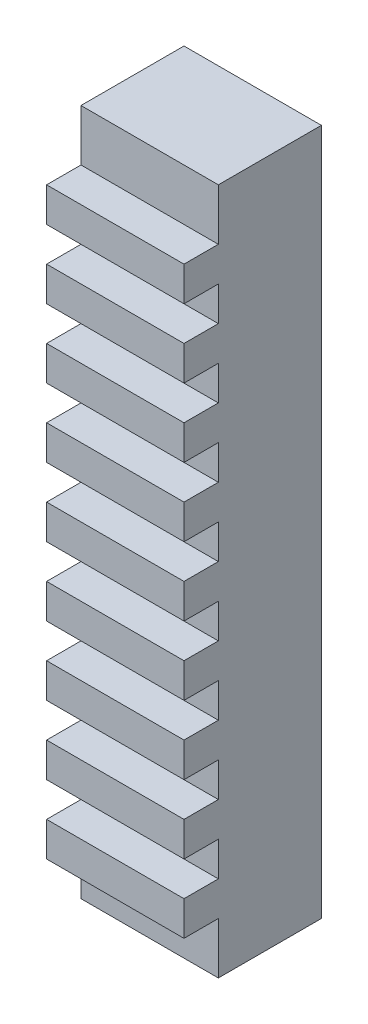
ISO-10303-21;
HEADER;
FILE_DESCRIPTION(('STEP AP214'),'2;1');
FILE_NAME('part.step','',(''),(''),'','','');
FILE_SCHEMA(('AUTOMOTIVE_DESIGN { 1 0 10303 214 1 1 1 1 }'));
ENDSEC;
DATA;
#1=APPLICATION_CONTEXT('core data for automotive mechanical design processes');
#2=APPLICATION_PROTOCOL_DEFINITION('international standard','automotive_design',2000,#1);
#3=PRODUCT_CONTEXT('',#1,'mechanical');
#4=PRODUCT('Part','Part','',(#3));
#5=PRODUCT_RELATED_PRODUCT_CATEGORY('part','',(#4));
#6=PRODUCT_DEFINITION_FORMATION('','',#4);
#7=PRODUCT_DEFINITION_CONTEXT('part definition',#1,'design');
#8=PRODUCT_DEFINITION('design','',#6,#7);
#9=PRODUCT_DEFINITION_SHAPE('','',#8);
#10=(LENGTH_UNIT() NAMED_UNIT(*) SI_UNIT(.MILLI.,.METRE.));
#11=(NAMED_UNIT(*) PLANE_ANGLE_UNIT() SI_UNIT($,.RADIAN.));
#12=(NAMED_UNIT(*) SI_UNIT($,.STERADIAN.) SOLID_ANGLE_UNIT());
#13=UNCERTAINTY_MEASURE_WITH_UNIT(LENGTH_MEASURE(1.E-05),#10,'distance_accuracy_value','');
#14=(GEOMETRIC_REPRESENTATION_CONTEXT(3) GLOBAL_UNCERTAINTY_ASSIGNED_CONTEXT((#13)) GLOBAL_UNIT_ASSIGNED_CONTEXT((#10,
#11,#12)) REPRESENTATION_CONTEXT('',''));
#15=CARTESIAN_POINT('',(0.,0.,0.));
#16=DIRECTION('',(0.,0.,1.));
#17=DIRECTION('',(1.,0.,0.));
#18=AXIS2_PLACEMENT_3D('',#15,#16,#17);
#19=CARTESIAN_POINT('',(0.,0.,15.));
#20=DIRECTION('',(0.,0.,-1.));
#21=DIRECTION('',(-1.,0.,0.));
#22=AXIS2_PLACEMENT_3D('',#19,#20,#21);
#23=PLANE('',#22);
#24=DIRECTION('',(-1.,0.,0.));
#25=VECTOR('',#24,1.);
#26=CARTESIAN_POINT('',(-10.,42.5,15.));
#27=LINE('',#26,#25);
#28=CARTESIAN_POINT('',(10.,42.5,15.));
#29=VERTEX_POINT('',#28);
#30=CARTESIAN_POINT('',(-10.,42.5,15.));
#31=VERTEX_POINT('',#30);
#32=EDGE_CURVE('E48',#29,#31,#27,.T.);
#33=ORIENTED_EDGE('',*,*,#32,.F.);
#34=DIRECTION('',(0.,1.,0.));
#35=VECTOR('',#34,1.);
#36=CARTESIAN_POINT('',(10.,-50.,15.));
#37=LINE('',#36,#35);
#38=CARTESIAN_POINT('',(10.,50.,15.));
#39=VERTEX_POINT('',#38);
#40=EDGE_CURVE('E540',#29,#39,#37,.T.);
#41=ORIENTED_EDGE('',*,*,#40,.T.);
#42=DIRECTION('',(-1.,0.,0.));
#43=VECTOR('',#42,1.);
#44=CARTESIAN_POINT('',(-10.,50.,15.));
#45=LINE('',#44,#43);
#46=CARTESIAN_POINT('',(-10.,50.,15.));
#47=VERTEX_POINT('',#46);
#48=EDGE_CURVE('E538',#39,#47,#45,.T.);
#49=ORIENTED_EDGE('',*,*,#48,.T.);
#50=DIRECTION('',(0.,-1.,0.));
#51=VECTOR('',#50,1.);
#52=CARTESIAN_POINT('',(-10.,-50.,15.));
#53=LINE('',#52,#51);
#54=EDGE_CURVE('E544',#47,#31,#53,.T.);
#55=ORIENTED_EDGE('',*,*,#54,.T.);
#56=EDGE_LOOP('',(#33,#41,#49,#55));
#57=FACE_BOUND('',#56,.T.);
#58=ADVANCED_FACE('F33',(#57),#23,.F.);
#59=DIRECTION('',(1.,0.,0.));
#60=VECTOR('',#59,1.);
#61=CARTESIAN_POINT('',(-10.,37.5,15.));
#62=LINE('',#61,#60);
#63=CARTESIAN_POINT('',(-10.,37.5,15.));
#64=VERTEX_POINT('',#63);
#65=CARTESIAN_POINT('',(10.,37.5,15.));
#66=VERTEX_POINT('',#65);
#67=EDGE_CURVE('E311',#64,#66,#62,.T.);
#68=ORIENTED_EDGE('',*,*,#67,.F.);
#69=CARTESIAN_POINT('',(-10.,32.5,15.));
#70=VERTEX_POINT('',#69);
#71=EDGE_CURVE('E547',#64,#70,#53,.T.);
#72=ORIENTED_EDGE('',*,*,#71,.T.);
#73=DIRECTION('',(-1.,0.,0.));
#74=VECTOR('',#73,1.);
#75=CARTESIAN_POINT('',(-10.,32.5,15.));
#76=LINE('',#75,#74);
#77=CARTESIAN_POINT('',(10.,32.5,15.));
#78=VERTEX_POINT('',#77);
#79=EDGE_CURVE('E314',#78,#70,#76,.T.);
#80=ORIENTED_EDGE('',*,*,#79,.F.);
#81=EDGE_CURVE('E56',#78,#66,#37,.T.);
#82=ORIENTED_EDGE('',*,*,#81,.T.);
#83=EDGE_LOOP('',(#68,#72,#80,#82));
#84=FACE_BOUND('',#83,.T.);
#85=ADVANCED_FACE('F639',(#84),#23,.F.);
#86=DIRECTION('',(1.,0.,0.));
#87=VECTOR('',#86,1.);
#88=CARTESIAN_POINT('',(-10.,27.5,15.));
#89=LINE('',#88,#87);
#90=CARTESIAN_POINT('',(-10.,27.5,15.));
#91=VERTEX_POINT('',#90);
#92=CARTESIAN_POINT('',(10.,27.5,15.));
#93=VERTEX_POINT('',#92);
#94=EDGE_CURVE('E317',#91,#93,#89,.T.);
#95=ORIENTED_EDGE('',*,*,#94,.F.);
#96=CARTESIAN_POINT('',(-10.,22.5,15.));
#97=VERTEX_POINT('',#96);
#98=EDGE_CURVE('E593',#91,#97,#53,.T.);
#99=ORIENTED_EDGE('',*,*,#98,.T.);
#100=DIRECTION('',(-1.,0.,0.));
#101=VECTOR('',#100,1.);
#102=CARTESIAN_POINT('',(-10.,22.5,15.));
#103=LINE('',#102,#101);
#104=CARTESIAN_POINT('',(10.,22.5,15.));
#105=VERTEX_POINT('',#104);
#106=EDGE_CURVE('E346',#105,#97,#103,.T.);
#107=ORIENTED_EDGE('',*,*,#106,.F.);
#108=EDGE_CURVE('E620',#105,#93,#37,.T.);
#109=ORIENTED_EDGE('',*,*,#108,.T.);
#110=EDGE_LOOP('',(#95,#99,#107,#109));
#111=FACE_BOUND('',#110,.T.);
#112=ADVANCED_FACE('F644',(#111),#23,.F.);
#113=DIRECTION('',(1.,0.,0.));
#114=VECTOR('',#113,1.);
#115=CARTESIAN_POINT('',(-10.,17.5,15.));
#116=LINE('',#115,#114);
#117=CARTESIAN_POINT('',(-10.,17.5,15.));
#118=VERTEX_POINT('',#117);
#119=CARTESIAN_POINT('',(10.,17.5,15.));
#120=VERTEX_POINT('',#119);
#121=EDGE_CURVE('E351',#118,#120,#116,.T.);
#122=ORIENTED_EDGE('',*,*,#121,.F.);
#123=CARTESIAN_POINT('',(-10.,12.5,15.));
#124=VERTEX_POINT('',#123);
#125=EDGE_CURVE('E591',#118,#124,#53,.T.);
#126=ORIENTED_EDGE('',*,*,#125,.T.);
#127=DIRECTION('',(-1.,0.,0.));
#128=VECTOR('',#127,1.);
#129=CARTESIAN_POINT('',(-10.,12.5,15.));
#130=LINE('',#129,#128);
#131=CARTESIAN_POINT('',(10.,12.5,15.));
#132=VERTEX_POINT('',#131);
#133=EDGE_CURVE('E454',#132,#124,#130,.T.);
#134=ORIENTED_EDGE('',*,*,#133,.F.);
#135=EDGE_CURVE('E622',#132,#120,#37,.T.);
#136=ORIENTED_EDGE('',*,*,#135,.T.);
#137=EDGE_LOOP('',(#122,#126,#134,#136));
#138=FACE_BOUND('',#137,.T.);
#139=ADVANCED_FACE('F735',(#138),#23,.F.);
#140=DIRECTION('',(-1.,0.,0.));
#141=VECTOR('',#140,1.);
#142=CARTESIAN_POINT('',(-10.,-37.5,15.));
#143=LINE('',#142,#141);
#144=CARTESIAN_POINT('',(10.,-37.5,15.));
#145=VERTEX_POINT('',#144);
#146=CARTESIAN_POINT('',(-10.,-37.5,15.));
#147=VERTEX_POINT('',#146);
#148=EDGE_CURVE('E373',#145,#147,#143,.T.);
#149=ORIENTED_EDGE('',*,*,#148,.F.);
#150=CARTESIAN_POINT('',(10.,-32.5,15.));
#151=VERTEX_POINT('',#150);
#152=EDGE_CURVE('E539',#145,#151,#37,.T.);
#153=ORIENTED_EDGE('',*,*,#152,.T.);
#154=DIRECTION('',(1.,0.,0.));
#155=VECTOR('',#154,1.);
#156=CARTESIAN_POINT('',(-10.,-32.5,15.));
#157=LINE('',#156,#155);
#158=CARTESIAN_POINT('',(-10.,-32.5,15.));
#159=VERTEX_POINT('',#158);
#160=EDGE_CURVE('E405',#159,#151,#157,.T.);
#161=ORIENTED_EDGE('',*,*,#160,.F.);
#162=EDGE_CURVE('E590',#159,#147,#53,.T.);
#163=ORIENTED_EDGE('',*,*,#162,.T.);
#164=EDGE_LOOP('',(#149,#153,#161,#163));
#165=FACE_BOUND('',#164,.T.);
#166=ADVANCED_FACE('F1005',(#165),#23,.F.);
#167=DIRECTION('',(1.,0.,0.));
#168=VECTOR('',#167,1.);
#169=CARTESIAN_POINT('',(-10.,-42.5,15.));
#170=LINE('',#169,#168);
#171=CARTESIAN_POINT('',(-10.,-42.5,15.));
#172=VERTEX_POINT('',#171);
#173=CARTESIAN_POINT('',(10.,-42.5,15.));
#174=VERTEX_POINT('',#173);
#175=EDGE_CURVE('E378',#172,#174,#170,.T.);
#176=ORIENTED_EDGE('',*,*,#175,.F.);
#177=CARTESIAN_POINT('',(-10.,-50.,15.));
#178=VERTEX_POINT('',#177);
#179=EDGE_CURVE('E543',#172,#178,#53,.T.);
#180=ORIENTED_EDGE('',*,*,#179,.T.);
#181=DIRECTION('',(1.,0.,0.));
#182=VECTOR('',#181,1.);
#183=CARTESIAN_POINT('',(-10.,-50.,15.));
#184=LINE('',#183,#182);
#185=CARTESIAN_POINT('',(10.,-50.,15.));
#186=VERTEX_POINT('',#185);
#187=EDGE_CURVE('E546',#178,#186,#184,.T.);
#188=ORIENTED_EDGE('',*,*,#187,.T.);
#189=EDGE_CURVE('E536',#186,#174,#37,.T.);
#190=ORIENTED_EDGE('',*,*,#189,.T.);
#191=EDGE_LOOP('',(#176,#180,#188,#190));
#192=FACE_BOUND('',#191,.T.);
#193=ADVANCED_FACE('F584',(#192),#23,.F.);
#194=DIRECTION('',(-1.,0.,0.));
#195=VECTOR('',#194,1.);
#196=CARTESIAN_POINT('',(-10.,-27.5,15.));
#197=LINE('',#196,#195);
#198=CARTESIAN_POINT('',(10.,-27.5,15.));
#199=VERTEX_POINT('',#198);
#200=CARTESIAN_POINT('',(-10.,-27.5,15.));
#201=VERTEX_POINT('',#200);
#202=EDGE_CURVE('E400',#199,#201,#197,.T.);
#203=ORIENTED_EDGE('',*,*,#202,.F.);
#204=CARTESIAN_POINT('',(10.,-22.5,15.));
#205=VERTEX_POINT('',#204);
#206=EDGE_CURVE('E616',#199,#205,#37,.T.);
#207=ORIENTED_EDGE('',*,*,#206,.T.);
#208=DIRECTION('',(1.,0.,0.));
#209=VECTOR('',#208,1.);
#210=CARTESIAN_POINT('',(-10.,-22.5,15.));
#211=LINE('',#210,#209);
#212=CARTESIAN_POINT('',(-10.,-22.5,15.));
#213=VERTEX_POINT('',#212);
#214=EDGE_CURVE('E432',#213,#205,#211,.T.);
#215=ORIENTED_EDGE('',*,*,#214,.F.);
#216=EDGE_CURVE('E592',#213,#201,#53,.T.);
#217=ORIENTED_EDGE('',*,*,#216,.T.);
#218=EDGE_LOOP('',(#203,#207,#215,#217));
#219=FACE_BOUND('',#218,.T.);
#220=ADVANCED_FACE('F602',(#219),#23,.F.);
#221=DIRECTION('',(-1.,0.,0.));
#222=VECTOR('',#221,1.);
#223=CARTESIAN_POINT('',(-10.,-17.5,15.));
#224=LINE('',#223,#222);
#225=CARTESIAN_POINT('',(10.,-17.5,15.));
#226=VERTEX_POINT('',#225);
#227=CARTESIAN_POINT('',(-10.,-17.5,15.));
#228=VERTEX_POINT('',#227);
#229=EDGE_CURVE('E427',#226,#228,#224,.T.);
#230=ORIENTED_EDGE('',*,*,#229,.F.);
#231=CARTESIAN_POINT('',(10.,-12.5,15.));
#232=VERTEX_POINT('',#231);
#233=EDGE_CURVE('E619',#226,#232,#37,.T.);
#234=ORIENTED_EDGE('',*,*,#233,.T.);
#235=DIRECTION('',(1.,0.,0.));
#236=VECTOR('',#235,1.);
#237=CARTESIAN_POINT('',(-10.,-12.5,15.));
#238=LINE('',#237,#236);
#239=CARTESIAN_POINT('',(-10.,-12.5,15.));
#240=VERTEX_POINT('',#239);
#241=EDGE_CURVE('E486',#240,#232,#238,.T.);
#242=ORIENTED_EDGE('',*,*,#241,.F.);
#243=EDGE_CURVE('E597',#240,#228,#53,.T.);
#244=ORIENTED_EDGE('',*,*,#243,.T.);
#245=EDGE_LOOP('',(#230,#234,#242,#244));
#246=FACE_BOUND('',#245,.T.);
#247=ADVANCED_FACE('F653',(#246),#23,.F.);
#248=DIRECTION('',(1.,0.,0.));
#249=VECTOR('',#248,1.);
#250=CARTESIAN_POINT('',(-10.,7.5,15.));
#251=LINE('',#250,#249);
#252=CARTESIAN_POINT('',(-10.,7.5,15.));
#253=VERTEX_POINT('',#252);
#254=CARTESIAN_POINT('',(10.,7.5,15.));
#255=VERTEX_POINT('',#254);
#256=EDGE_CURVE('E459',#253,#255,#251,.T.);
#257=ORIENTED_EDGE('',*,*,#256,.F.);
#258=CARTESIAN_POINT('',(-10.,2.5,15.));
#259=VERTEX_POINT('',#258);
#260=EDGE_CURVE('E594',#253,#259,#53,.T.);
#261=ORIENTED_EDGE('',*,*,#260,.T.);
#262=DIRECTION('',(-1.,0.,0.));
#263=VECTOR('',#262,1.);
#264=CARTESIAN_POINT('',(-10.,2.5,15.));
#265=LINE('',#264,#263);
#266=CARTESIAN_POINT('',(10.,2.5,15.));
#267=VERTEX_POINT('',#266);
#268=EDGE_CURVE('E508',#267,#259,#265,.T.);
#269=ORIENTED_EDGE('',*,*,#268,.F.);
#270=EDGE_CURVE('E541',#267,#255,#37,.T.);
#271=ORIENTED_EDGE('',*,*,#270,.T.);
#272=EDGE_LOOP('',(#257,#261,#269,#271));
#273=FACE_BOUND('',#272,.T.);
#274=ADVANCED_FACE('F648',(#273),#23,.F.);
#275=DIRECTION('',(-1.,0.,0.));
#276=VECTOR('',#275,1.);
#277=CARTESIAN_POINT('',(-10.,-7.5,15.));
#278=LINE('',#277,#276);
#279=CARTESIAN_POINT('',(10.,-7.5,15.));
#280=VERTEX_POINT('',#279);
#281=CARTESIAN_POINT('',(-10.,-7.5,15.));
#282=VERTEX_POINT('',#281);
#283=EDGE_CURVE('E481',#280,#282,#278,.T.);
#284=ORIENTED_EDGE('',*,*,#283,.F.);
#285=CARTESIAN_POINT('',(10.,-2.5,15.));
#286=VERTEX_POINT('',#285);
#287=EDGE_CURVE('E621',#280,#286,#37,.T.);
#288=ORIENTED_EDGE('',*,*,#287,.T.);
#289=DIRECTION('',(1.,0.,0.));
#290=VECTOR('',#289,1.);
#291=CARTESIAN_POINT('',(-10.,-2.5,15.));
#292=LINE('',#291,#290);
#293=CARTESIAN_POINT('',(-10.,-2.5,15.));
#294=VERTEX_POINT('',#293);
#295=EDGE_CURVE('E513',#294,#286,#292,.T.);
#296=ORIENTED_EDGE('',*,*,#295,.F.);
#297=EDGE_CURVE('E548',#294,#282,#53,.T.);
#298=ORIENTED_EDGE('',*,*,#297,.T.);
#299=EDGE_LOOP('',(#284,#288,#296,#298));
#300=FACE_BOUND('',#299,.T.);
#301=ADVANCED_FACE('F637',(#300),#23,.F.);
#302=CARTESIAN_POINT('',(10.,-50.,15.));
#303=DIRECTION('',(-1.,0.,0.));
#304=DIRECTION('',(0.,0.,1.));
#305=AXIS2_PLACEMENT_3D('',#302,#303,#304);
#306=PLANE('',#305);
#307=DIRECTION('',(0.,1.,0.));
#308=VECTOR('',#307,1.);
#309=CARTESIAN_POINT('',(10.,-50.,0.));
#310=LINE('',#309,#308);
#311=CARTESIAN_POINT('',(10.,-50.,0.));
#312=VERTEX_POINT('',#311);
#313=CARTESIAN_POINT('',(10.,50.,0.));
#314=VERTEX_POINT('',#313);
#315=EDGE_CURVE('E535',#312,#314,#310,.T.);
#316=ORIENTED_EDGE('',*,*,#315,.T.);
#317=DIRECTION('',(0.,0.,-1.));
#318=VECTOR('',#317,1.);
#319=CARTESIAN_POINT('',(10.,50.,15.));
#320=LINE('',#319,#318);
#321=EDGE_CURVE('E11',#39,#314,#320,.T.);
#322=ORIENTED_EDGE('',*,*,#321,.F.);
#323=ORIENTED_EDGE('',*,*,#40,.F.);
#324=DIRECTION('',(0.,0.,-1.));
#325=VECTOR('',#324,1.);
#326=CARTESIAN_POINT('',(10.,42.5,20.));
#327=LINE('',#326,#325);
#328=CARTESIAN_POINT('',(10.,42.5,20.));
#329=VERTEX_POINT('',#328);
#330=EDGE_CURVE('E765',#329,#29,#327,.T.);
#331=ORIENTED_EDGE('',*,*,#330,.F.);
#332=DIRECTION('',(0.,1.,0.));
#333=VECTOR('',#332,1.);
#334=CARTESIAN_POINT('',(10.,37.5,20.));
#335=LINE('',#334,#333);
#336=CARTESIAN_POINT('',(10.,37.5,20.));
#337=VERTEX_POINT('',#336);
#338=EDGE_CURVE('E307',#337,#329,#335,.T.);
#339=ORIENTED_EDGE('',*,*,#338,.F.);
#340=DIRECTION('',(0.,0.,-1.));
#341=VECTOR('',#340,1.);
#342=CARTESIAN_POINT('',(10.,37.5,20.));
#343=LINE('',#342,#341);
#344=EDGE_CURVE('E319',#337,#66,#343,.T.);
#345=ORIENTED_EDGE('',*,*,#344,.T.);
#346=ORIENTED_EDGE('',*,*,#81,.F.);
#347=DIRECTION('',(0.,0.,-1.));
#348=VECTOR('',#347,1.);
#349=CARTESIAN_POINT('',(10.,32.5,20.));
#350=LINE('',#349,#348);
#351=CARTESIAN_POINT('',(10.,32.5,20.));
#352=VERTEX_POINT('',#351);
#353=EDGE_CURVE('E331',#352,#78,#350,.T.);
#354=ORIENTED_EDGE('',*,*,#353,.F.);
#355=DIRECTION('',(0.,1.,0.));
#356=VECTOR('',#355,1.);
#357=CARTESIAN_POINT('',(10.,27.5,20.));
#358=LINE('',#357,#356);
#359=CARTESIAN_POINT('',(10.,27.5,20.));
#360=VERTEX_POINT('',#359);
#361=EDGE_CURVE('E330',#360,#352,#358,.T.);
#362=ORIENTED_EDGE('',*,*,#361,.F.);
#363=DIRECTION('',(0.,0.,-1.));
#364=VECTOR('',#363,1.);
#365=CARTESIAN_POINT('',(10.,27.5,20.));
#366=LINE('',#365,#364);
#367=EDGE_CURVE('E337',#360,#93,#366,.T.);
#368=ORIENTED_EDGE('',*,*,#367,.T.);
#369=ORIENTED_EDGE('',*,*,#108,.F.);
#370=DIRECTION('',(0.,0.,-1.));
#371=VECTOR('',#370,1.);
#372=CARTESIAN_POINT('',(10.,22.5,20.));
#373=LINE('',#372,#371);
#374=CARTESIAN_POINT('',(10.,22.5,20.));
#375=VERTEX_POINT('',#374);
#376=EDGE_CURVE('E357',#375,#105,#373,.T.);
#377=ORIENTED_EDGE('',*,*,#376,.F.);
#378=DIRECTION('',(0.,1.,0.));
#379=VECTOR('',#378,1.);
#380=CARTESIAN_POINT('',(10.,17.5,20.));
#381=LINE('',#380,#379);
#382=CARTESIAN_POINT('',(10.,17.5,20.));
#383=VERTEX_POINT('',#382);
#384=EDGE_CURVE('E355',#383,#375,#381,.T.);
#385=ORIENTED_EDGE('',*,*,#384,.F.);
#386=DIRECTION('',(0.,0.,-1.));
#387=VECTOR('',#386,1.);
#388=CARTESIAN_POINT('',(10.,17.5,20.));
#389=LINE('',#388,#387);
#390=EDGE_CURVE('E364',#383,#120,#389,.T.);
#391=ORIENTED_EDGE('',*,*,#390,.T.);
#392=ORIENTED_EDGE('',*,*,#135,.F.);
#393=DIRECTION('',(0.,0.,-1.));
#394=VECTOR('',#393,1.);
#395=CARTESIAN_POINT('',(10.,12.5,20.));
#396=LINE('',#395,#394);
#397=CARTESIAN_POINT('',(10.,12.5,20.));
#398=VERTEX_POINT('',#397);
#399=EDGE_CURVE('E465',#398,#132,#396,.T.);
#400=ORIENTED_EDGE('',*,*,#399,.F.);
#401=DIRECTION('',(0.,1.,0.));
#402=VECTOR('',#401,1.);
#403=CARTESIAN_POINT('',(10.,7.5,20.));
#404=LINE('',#403,#402);
#405=CARTESIAN_POINT('',(10.,7.5,20.));
#406=VERTEX_POINT('',#405);
#407=EDGE_CURVE('E463',#406,#398,#404,.T.);
#408=ORIENTED_EDGE('',*,*,#407,.F.);
#409=DIRECTION('',(0.,0.,-1.));
#410=VECTOR('',#409,1.);
#411=CARTESIAN_POINT('',(10.,7.5,20.));
#412=LINE('',#411,#410);
#413=EDGE_CURVE('E472',#406,#255,#412,.T.);
#414=ORIENTED_EDGE('',*,*,#413,.T.);
#415=ORIENTED_EDGE('',*,*,#270,.F.);
#416=DIRECTION('',(0.,0.,-1.));
#417=VECTOR('',#416,1.);
#418=CARTESIAN_POINT('',(10.,2.5,20.));
#419=LINE('',#418,#417);
#420=CARTESIAN_POINT('',(10.,2.5,20.));
#421=VERTEX_POINT('',#420);
#422=EDGE_CURVE('E532',#421,#267,#419,.T.);
#423=ORIENTED_EDGE('',*,*,#422,.F.);
#424=DIRECTION('',(0.,1.,0.));
#425=VECTOR('',#424,1.);
#426=CARTESIAN_POINT('',(10.,-2.5,20.));
#427=LINE('',#426,#425);
#428=CARTESIAN_POINT('',(10.,-2.5,20.));
#429=VERTEX_POINT('',#428);
#430=EDGE_CURVE('E509',#429,#421,#427,.T.);
#431=ORIENTED_EDGE('',*,*,#430,.F.);
#432=DIRECTION('',(0.,0.,-1.));
#433=VECTOR('',#432,1.);
#434=CARTESIAN_POINT('',(10.,-2.5,20.));
#435=LINE('',#434,#433);
#436=EDGE_CURVE('E519',#429,#286,#435,.T.);
#437=ORIENTED_EDGE('',*,*,#436,.T.);
#438=ORIENTED_EDGE('',*,*,#287,.F.);
#439=DIRECTION('',(0.,0.,-1.));
#440=VECTOR('',#439,1.);
#441=CARTESIAN_POINT('',(10.,-7.5,20.));
#442=LINE('',#441,#440);
#443=CARTESIAN_POINT('',(10.,-7.5,20.));
#444=VERTEX_POINT('',#443);
#445=EDGE_CURVE('E505',#444,#280,#442,.T.);
#446=ORIENTED_EDGE('',*,*,#445,.F.);
#447=DIRECTION('',(0.,1.,0.));
#448=VECTOR('',#447,1.);
#449=CARTESIAN_POINT('',(10.,-12.5,20.));
#450=LINE('',#449,#448);
#451=CARTESIAN_POINT('',(10.,-12.5,20.));
#452=VERTEX_POINT('',#451);
#453=EDGE_CURVE('E482',#452,#444,#450,.T.);
#454=ORIENTED_EDGE('',*,*,#453,.F.);
#455=DIRECTION('',(0.,0.,-1.));
#456=VECTOR('',#455,1.);
#457=CARTESIAN_POINT('',(10.,-12.5,20.));
#458=LINE('',#457,#456);
#459=EDGE_CURVE('E492',#452,#232,#458,.T.);
#460=ORIENTED_EDGE('',*,*,#459,.T.);
#461=ORIENTED_EDGE('',*,*,#233,.F.);
#462=DIRECTION('',(0.,0.,-1.));
#463=VECTOR('',#462,1.);
#464=CARTESIAN_POINT('',(10.,-17.5,20.));
#465=LINE('',#464,#463);
#466=CARTESIAN_POINT('',(10.,-17.5,20.));
#467=VERTEX_POINT('',#466);
#468=EDGE_CURVE('E451',#467,#226,#465,.T.);
#469=ORIENTED_EDGE('',*,*,#468,.F.);
#470=DIRECTION('',(0.,1.,0.));
#471=VECTOR('',#470,1.);
#472=CARTESIAN_POINT('',(10.,-22.5,20.));
#473=LINE('',#472,#471);
#474=CARTESIAN_POINT('',(10.,-22.5,20.));
#475=VERTEX_POINT('',#474);
#476=EDGE_CURVE('E428',#475,#467,#473,.T.);
#477=ORIENTED_EDGE('',*,*,#476,.F.);
#478=DIRECTION('',(0.,0.,-1.));
#479=VECTOR('',#478,1.);
#480=CARTESIAN_POINT('',(10.,-22.5,20.));
#481=LINE('',#480,#479);
#482=EDGE_CURVE('E438',#475,#205,#481,.T.);
#483=ORIENTED_EDGE('',*,*,#482,.T.);
#484=ORIENTED_EDGE('',*,*,#206,.F.);
#485=DIRECTION('',(0.,0.,-1.));
#486=VECTOR('',#485,1.);
#487=CARTESIAN_POINT('',(10.,-27.5,20.));
#488=LINE('',#487,#486);
#489=CARTESIAN_POINT('',(10.,-27.5,20.));
#490=VERTEX_POINT('',#489);
#491=EDGE_CURVE('E424',#490,#199,#488,.T.);
#492=ORIENTED_EDGE('',*,*,#491,.F.);
#493=DIRECTION('',(0.,1.,0.));
#494=VECTOR('',#493,1.);
#495=CARTESIAN_POINT('',(10.,-32.5,20.));
#496=LINE('',#495,#494);
#497=CARTESIAN_POINT('',(10.,-32.5,20.));
#498=VERTEX_POINT('',#497);
#499=EDGE_CURVE('E401',#498,#490,#496,.T.);
#500=ORIENTED_EDGE('',*,*,#499,.F.);
#501=DIRECTION('',(0.,0.,-1.));
#502=VECTOR('',#501,1.);
#503=CARTESIAN_POINT('',(10.,-32.5,20.));
#504=LINE('',#503,#502);
#505=EDGE_CURVE('E411',#498,#151,#504,.T.);
#506=ORIENTED_EDGE('',*,*,#505,.T.);
#507=ORIENTED_EDGE('',*,*,#152,.F.);
#508=DIRECTION('',(0.,0.,-1.));
#509=VECTOR('',#508,1.);
#510=CARTESIAN_POINT('',(10.,-37.5,20.));
#511=LINE('',#510,#509);
#512=CARTESIAN_POINT('',(10.,-37.5,20.));
#513=VERTEX_POINT('',#512);
#514=EDGE_CURVE('E397',#513,#145,#511,.T.);
#515=ORIENTED_EDGE('',*,*,#514,.F.);
#516=DIRECTION('',(0.,1.,0.));
#517=VECTOR('',#516,1.);
#518=CARTESIAN_POINT('',(10.,-42.5,20.));
#519=LINE('',#518,#517);
#520=CARTESIAN_POINT('',(10.,-42.5,20.));
#521=VERTEX_POINT('',#520);
#522=EDGE_CURVE('E374',#521,#513,#519,.T.);
#523=ORIENTED_EDGE('',*,*,#522,.F.);
#524=DIRECTION('',(0.,0.,-1.));
#525=VECTOR('',#524,1.);
#526=CARTESIAN_POINT('',(10.,-42.5,20.));
#527=LINE('',#526,#525);
#528=EDGE_CURVE('E384',#521,#174,#527,.T.);
#529=ORIENTED_EDGE('',*,*,#528,.T.);
#530=ORIENTED_EDGE('',*,*,#189,.F.);
#531=DIRECTION('',(0.,0.,-1.));
#532=VECTOR('',#531,1.);
#533=CARTESIAN_POINT('',(10.,-50.,15.));
#534=LINE('',#533,#532);
#535=EDGE_CURVE('E550',#186,#312,#534,.T.);
#536=ORIENTED_EDGE('',*,*,#535,.T.);
#537=EDGE_LOOP('',(#316,#322,#323,#331,#339,#345,#346,#354,#362,#368,#369,#377,#385,#391,#392,
#400,#408,#414,#415,#423,#431,#437,#438,#446,#454,#460,#461,#469,#477,#483,#484,#492,#500,#506,
#507,#515,#523,#529,#530,#536));
#538=FACE_BOUND('',#537,.T.);
#539=ADVANCED_FACE('F35',(#538),#306,.F.);
#540=CARTESIAN_POINT('',(-10.,50.,15.));
#541=DIRECTION('',(0.,-1.,0.));
#542=DIRECTION('',(0.,0.,-1.));
#543=AXIS2_PLACEMENT_3D('',#540,#541,#542);
#544=PLANE('',#543);
#545=DIRECTION('',(-1.,0.,0.));
#546=VECTOR('',#545,1.);
#547=CARTESIAN_POINT('',(-10.,50.,0.));
#548=LINE('',#547,#546);
#549=CARTESIAN_POINT('',(-10.,50.,0.));
#550=VERTEX_POINT('',#549);
#551=EDGE_CURVE('E553',#314,#550,#548,.T.);
#552=ORIENTED_EDGE('',*,*,#551,.T.);
#553=DIRECTION('',(0.,0.,-1.));
#554=VECTOR('',#553,1.);
#555=CARTESIAN_POINT('',(-10.,50.,15.));
#556=LINE('',#555,#554);
#557=EDGE_CURVE('E41',#47,#550,#556,.T.);
#558=ORIENTED_EDGE('',*,*,#557,.F.);
#559=ORIENTED_EDGE('',*,*,#48,.F.);
#560=ORIENTED_EDGE('',*,*,#321,.T.);
#561=EDGE_LOOP('',(#552,#558,#559,#560));
#562=FACE_BOUND('',#561,.T.);
#563=ADVANCED_FACE('F630',(#562),#544,.F.);
#564=CARTESIAN_POINT('',(-10.,-50.,15.));
#565=DIRECTION('',(1.,0.,0.));
#566=DIRECTION('',(0.,0.,-1.));
#567=AXIS2_PLACEMENT_3D('',#564,#565,#566);
#568=PLANE('',#567);
#569=DIRECTION('',(0.,-1.,0.));
#570=VECTOR('',#569,1.);
#571=CARTESIAN_POINT('',(-10.,-50.,0.));
#572=LINE('',#571,#570);
#573=CARTESIAN_POINT('',(-10.,-50.,0.));
#574=VERTEX_POINT('',#573);
#575=EDGE_CURVE('E555',#550,#574,#572,.T.);
#576=ORIENTED_EDGE('',*,*,#575,.T.);
#577=DIRECTION('',(0.,0.,-1.));
#578=VECTOR('',#577,1.);
#579=CARTESIAN_POINT('',(-10.,-50.,15.));
#580=LINE('',#579,#578);
#581=EDGE_CURVE('E561',#178,#574,#580,.T.);
#582=ORIENTED_EDGE('',*,*,#581,.F.);
#583=ORIENTED_EDGE('',*,*,#179,.F.);
#584=DIRECTION('',(0.,0.,-1.));
#585=VECTOR('',#584,1.);
#586=CARTESIAN_POINT('',(-10.,-42.5,20.));
#587=LINE('',#586,#585);
#588=CARTESIAN_POINT('',(-10.,-42.5,20.));
#589=VERTEX_POINT('',#588);
#590=EDGE_CURVE('E391',#589,#172,#587,.T.);
#591=ORIENTED_EDGE('',*,*,#590,.F.);
#592=DIRECTION('',(0.,-1.,0.));
#593=VECTOR('',#592,1.);
#594=CARTESIAN_POINT('',(-10.,-42.5,20.));
#595=LINE('',#594,#593);
#596=CARTESIAN_POINT('',(-10.,-37.5,20.));
#597=VERTEX_POINT('',#596);
#598=EDGE_CURVE('E380',#597,#589,#595,.T.);
#599=ORIENTED_EDGE('',*,*,#598,.F.);
#600=DIRECTION('',(0.,0.,-1.));
#601=VECTOR('',#600,1.);
#602=CARTESIAN_POINT('',(-10.,-37.5,20.));
#603=LINE('',#602,#601);
#604=EDGE_CURVE('E394',#597,#147,#603,.T.);
#605=ORIENTED_EDGE('',*,*,#604,.T.);
#606=ORIENTED_EDGE('',*,*,#162,.F.);
#607=DIRECTION('',(0.,0.,-1.));
#608=VECTOR('',#607,1.);
#609=CARTESIAN_POINT('',(-10.,-32.5,20.));
#610=LINE('',#609,#608);
#611=CARTESIAN_POINT('',(-10.,-32.5,20.));
#612=VERTEX_POINT('',#611);
#613=EDGE_CURVE('E418',#612,#159,#610,.T.);
#614=ORIENTED_EDGE('',*,*,#613,.F.);
#615=DIRECTION('',(0.,-1.,0.));
#616=VECTOR('',#615,1.);
#617=CARTESIAN_POINT('',(-10.,-32.5,20.));
#618=LINE('',#617,#616);
#619=CARTESIAN_POINT('',(-10.,-27.5,20.));
#620=VERTEX_POINT('',#619);
#621=EDGE_CURVE('E407',#620,#612,#618,.T.);
#622=ORIENTED_EDGE('',*,*,#621,.F.);
#623=DIRECTION('',(0.,0.,-1.));
#624=VECTOR('',#623,1.);
#625=CARTESIAN_POINT('',(-10.,-27.5,20.));
#626=LINE('',#625,#624);
#627=EDGE_CURVE('E421',#620,#201,#626,.T.);
#628=ORIENTED_EDGE('',*,*,#627,.T.);
#629=ORIENTED_EDGE('',*,*,#216,.F.);
#630=DIRECTION('',(0.,0.,-1.));
#631=VECTOR('',#630,1.);
#632=CARTESIAN_POINT('',(-10.,-22.5,20.));
#633=LINE('',#632,#631);
#634=CARTESIAN_POINT('',(-10.,-22.5,20.));
#635=VERTEX_POINT('',#634);
#636=EDGE_CURVE('E445',#635,#213,#633,.T.);
#637=ORIENTED_EDGE('',*,*,#636,.F.);
#638=DIRECTION('',(0.,-1.,0.));
#639=VECTOR('',#638,1.);
#640=CARTESIAN_POINT('',(-10.,-22.5,20.));
#641=LINE('',#640,#639);
#642=CARTESIAN_POINT('',(-10.,-17.5,20.));
#643=VERTEX_POINT('',#642);
#644=EDGE_CURVE('E434',#643,#635,#641,.T.);
#645=ORIENTED_EDGE('',*,*,#644,.F.);
#646=DIRECTION('',(0.,0.,-1.));
#647=VECTOR('',#646,1.);
#648=CARTESIAN_POINT('',(-10.,-17.5,20.));
#649=LINE('',#648,#647);
#650=EDGE_CURVE('E448',#643,#228,#649,.T.);
#651=ORIENTED_EDGE('',*,*,#650,.T.);
#652=ORIENTED_EDGE('',*,*,#243,.F.);
#653=DIRECTION('',(0.,0.,-1.));
#654=VECTOR('',#653,1.);
#655=CARTESIAN_POINT('',(-10.,-12.5,20.));
#656=LINE('',#655,#654);
#657=CARTESIAN_POINT('',(-10.,-12.5,20.));
#658=VERTEX_POINT('',#657);
#659=EDGE_CURVE('E499',#658,#240,#656,.T.);
#660=ORIENTED_EDGE('',*,*,#659,.F.);
#661=DIRECTION('',(0.,-1.,0.));
#662=VECTOR('',#661,1.);
#663=CARTESIAN_POINT('',(-10.,-12.5,20.));
#664=LINE('',#663,#662);
#665=CARTESIAN_POINT('',(-10.,-7.5,20.));
#666=VERTEX_POINT('',#665);
#667=EDGE_CURVE('E488',#666,#658,#664,.T.);
#668=ORIENTED_EDGE('',*,*,#667,.F.);
#669=DIRECTION('',(0.,0.,-1.));
#670=VECTOR('',#669,1.);
#671=CARTESIAN_POINT('',(-10.,-7.5,20.));
#672=LINE('',#671,#670);
#673=EDGE_CURVE('E502',#666,#282,#672,.T.);
#674=ORIENTED_EDGE('',*,*,#673,.T.);
#675=ORIENTED_EDGE('',*,*,#297,.F.);
#676=DIRECTION('',(0.,0.,-1.));
#677=VECTOR('',#676,1.);
#678=CARTESIAN_POINT('',(-10.,-2.5,20.));
#679=LINE('',#678,#677);
#680=CARTESIAN_POINT('',(-10.,-2.5,20.));
#681=VERTEX_POINT('',#680);
#682=EDGE_CURVE('E526',#681,#294,#679,.T.);
#683=ORIENTED_EDGE('',*,*,#682,.F.);
#684=DIRECTION('',(0.,-1.,0.));
#685=VECTOR('',#684,1.);
#686=CARTESIAN_POINT('',(-10.,-2.5,20.));
#687=LINE('',#686,#685);
#688=CARTESIAN_POINT('',(-10.,2.5,20.));
#689=VERTEX_POINT('',#688);
#690=EDGE_CURVE('E515',#689,#681,#687,.T.);
#691=ORIENTED_EDGE('',*,*,#690,.F.);
#692=DIRECTION('',(0.,0.,-1.));
#693=VECTOR('',#692,1.);
#694=CARTESIAN_POINT('',(-10.,2.5,20.));
#695=LINE('',#694,#693);
#696=EDGE_CURVE('E529',#689,#259,#695,.T.);
#697=ORIENTED_EDGE('',*,*,#696,.T.);
#698=ORIENTED_EDGE('',*,*,#260,.F.);
#699=DIRECTION('',(0.,0.,-1.));
#700=VECTOR('',#699,1.);
#701=CARTESIAN_POINT('',(-10.,7.5,20.));
#702=LINE('',#701,#700);
#703=CARTESIAN_POINT('',(-10.,7.5,20.));
#704=VERTEX_POINT('',#703);
#705=EDGE_CURVE('E475',#704,#253,#702,.T.);
#706=ORIENTED_EDGE('',*,*,#705,.F.);
#707=DIRECTION('',(0.,-1.,0.));
#708=VECTOR('',#707,1.);
#709=CARTESIAN_POINT('',(-10.,7.5,20.));
#710=LINE('',#709,#708);
#711=CARTESIAN_POINT('',(-10.,12.5,20.));
#712=VERTEX_POINT('',#711);
#713=EDGE_CURVE('E458',#712,#704,#710,.T.);
#714=ORIENTED_EDGE('',*,*,#713,.F.);
#715=DIRECTION('',(0.,0.,-1.));
#716=VECTOR('',#715,1.);
#717=CARTESIAN_POINT('',(-10.,12.5,20.));
#718=LINE('',#717,#716);
#719=EDGE_CURVE('E478',#712,#124,#718,.T.);
#720=ORIENTED_EDGE('',*,*,#719,.T.);
#721=ORIENTED_EDGE('',*,*,#125,.F.);
#722=DIRECTION('',(0.,0.,-1.));
#723=VECTOR('',#722,1.);
#724=CARTESIAN_POINT('',(-10.,17.5,20.));
#725=LINE('',#724,#723);
#726=CARTESIAN_POINT('',(-10.,17.5,20.));
#727=VERTEX_POINT('',#726);
#728=EDGE_CURVE('E367',#727,#118,#725,.T.);
#729=ORIENTED_EDGE('',*,*,#728,.F.);
#730=DIRECTION('',(0.,-1.,0.));
#731=VECTOR('',#730,1.);
#732=CARTESIAN_POINT('',(-10.,17.5,20.));
#733=LINE('',#732,#731);
#734=CARTESIAN_POINT('',(-10.,22.5,20.));
#735=VERTEX_POINT('',#734);
#736=EDGE_CURVE('E350',#735,#727,#733,.T.);
#737=ORIENTED_EDGE('',*,*,#736,.F.);
#738=DIRECTION('',(0.,0.,-1.));
#739=VECTOR('',#738,1.);
#740=CARTESIAN_POINT('',(-10.,22.5,20.));
#741=LINE('',#740,#739);
#742=EDGE_CURVE('E370',#735,#97,#741,.T.);
#743=ORIENTED_EDGE('',*,*,#742,.T.);
#744=ORIENTED_EDGE('',*,*,#98,.F.);
#745=DIRECTION('',(0.,0.,-1.));
#746=VECTOR('',#745,1.);
#747=CARTESIAN_POINT('',(-10.,27.5,20.));
#748=LINE('',#747,#746);
#749=CARTESIAN_POINT('',(-10.,27.5,20.));
#750=VERTEX_POINT('',#749);
#751=EDGE_CURVE('E340',#750,#91,#748,.T.);
#752=ORIENTED_EDGE('',*,*,#751,.F.);
#753=DIRECTION('',(0.,-1.,0.));
#754=VECTOR('',#753,1.);
#755=CARTESIAN_POINT('',(-10.,27.5,20.));
#756=LINE('',#755,#754);
#757=CARTESIAN_POINT('',(-10.,32.5,20.));
#758=VERTEX_POINT('',#757);
#759=EDGE_CURVE('E326',#758,#750,#756,.T.);
#760=ORIENTED_EDGE('',*,*,#759,.F.);
#761=DIRECTION('',(0.,0.,-1.));
#762=VECTOR('',#761,1.);
#763=CARTESIAN_POINT('',(-10.,32.5,20.));
#764=LINE('',#763,#762);
#765=EDGE_CURVE('E343',#758,#70,#764,.T.);
#766=ORIENTED_EDGE('',*,*,#765,.T.);
#767=ORIENTED_EDGE('',*,*,#71,.F.);
#768=DIRECTION('',(0.,0.,-1.));
#769=VECTOR('',#768,1.);
#770=CARTESIAN_POINT('',(-10.,37.5,20.));
#771=LINE('',#770,#769);
#772=CARTESIAN_POINT('',(-10.,37.5,20.));
#773=VERTEX_POINT('',#772);
#774=EDGE_CURVE('E298',#773,#64,#771,.T.);
#775=ORIENTED_EDGE('',*,*,#774,.F.);
#776=DIRECTION('',(0.,-1.,0.));
#777=VECTOR('',#776,1.);
#778=CARTESIAN_POINT('',(-10.,37.5,20.));
#779=LINE('',#778,#777);
#780=CARTESIAN_POINT('',(-10.,42.5,20.));
#781=VERTEX_POINT('',#780);
#782=EDGE_CURVE('E291',#781,#773,#779,.T.);
#783=ORIENTED_EDGE('',*,*,#782,.F.);
#784=DIRECTION('',(0.,0.,-1.));
#785=VECTOR('',#784,1.);
#786=CARTESIAN_POINT('',(-10.,42.5,20.));
#787=LINE('',#786,#785);
#788=EDGE_CURVE('E296',#781,#31,#787,.T.);
#789=ORIENTED_EDGE('',*,*,#788,.T.);
#790=ORIENTED_EDGE('',*,*,#54,.F.);
#791=ORIENTED_EDGE('',*,*,#557,.T.);
#792=EDGE_LOOP('',(#576,#582,#583,#591,#599,#605,#606,#614,#622,#628,#629,#637,#645,#651,#652,
#660,#668,#674,#675,#683,#691,#697,#698,#706,#714,#720,#721,#729,#737,#743,#744,#752,#760,#766,
#767,#775,#783,#789,#790,#791));
#793=FACE_BOUND('',#792,.T.);
#794=ADVANCED_FACE('F293',(#793),#568,.F.);
#795=CARTESIAN_POINT('',(-10.,-50.,15.));
#796=DIRECTION('',(0.,1.,0.));
#797=DIRECTION('',(0.,0.,1.));
#798=AXIS2_PLACEMENT_3D('',#795,#796,#797);
#799=PLANE('',#798);
#800=DIRECTION('',(1.,0.,0.));
#801=VECTOR('',#800,1.);
#802=CARTESIAN_POINT('',(-10.,-50.,0.));
#803=LINE('',#802,#801);
#804=EDGE_CURVE('E557',#574,#312,#803,.T.);
#805=ORIENTED_EDGE('',*,*,#804,.T.);
#806=ORIENTED_EDGE('',*,*,#535,.F.);
#807=ORIENTED_EDGE('',*,*,#187,.F.);
#808=ORIENTED_EDGE('',*,*,#581,.T.);
#809=EDGE_LOOP('',(#805,#806,#807,#808));
#810=FACE_BOUND('',#809,.T.);
#811=ADVANCED_FACE('F575',(#810),#799,.F.);
#812=CARTESIAN_POINT('',(0.,0.,0.));
#813=DIRECTION('',(0.,0.,-1.));
#814=DIRECTION('',(-1.,0.,0.));
#815=AXIS2_PLACEMENT_3D('',#812,#813,#814);
#816=PLANE('',#815);
#817=ORIENTED_EDGE('',*,*,#315,.F.);
#818=ORIENTED_EDGE('',*,*,#804,.F.);
#819=ORIENTED_EDGE('',*,*,#575,.F.);
#820=ORIENTED_EDGE('',*,*,#551,.F.);
#821=EDGE_LOOP('',(#817,#818,#819,#820));
#822=FACE_BOUND('',#821,.T.);
#823=ADVANCED_FACE('F572',(#822),#816,.T.);
#824=CARTESIAN_POINT('',(-10.,2.5,20.));
#825=DIRECTION('',(0.,-1.,0.));
#826=DIRECTION('',(0.,0.,-1.));
#827=AXIS2_PLACEMENT_3D('',#824,#825,#826);
#828=PLANE('',#827);
#829=ORIENTED_EDGE('',*,*,#268,.T.);
#830=ORIENTED_EDGE('',*,*,#696,.F.);
#831=DIRECTION('',(-1.,0.,0.));
#832=VECTOR('',#831,1.);
#833=CARTESIAN_POINT('',(-10.,2.5,20.));
#834=LINE('',#833,#832);
#835=EDGE_CURVE('E512',#421,#689,#834,.T.);
#836=ORIENTED_EDGE('',*,*,#835,.F.);
#837=ORIENTED_EDGE('',*,*,#422,.T.);
#838=EDGE_LOOP('',(#829,#830,#836,#837));
#839=FACE_BOUND('',#838,.T.);
#840=ADVANCED_FACE('F715',(#839),#828,.F.);
#841=CARTESIAN_POINT('',(-10.,-2.5,20.));
#842=DIRECTION('',(0.,1.,0.));
#843=DIRECTION('',(0.,0.,1.));
#844=AXIS2_PLACEMENT_3D('',#841,#842,#843);
#845=PLANE('',#844);
#846=ORIENTED_EDGE('',*,*,#295,.T.);
#847=ORIENTED_EDGE('',*,*,#436,.F.);
#848=DIRECTION('',(1.,0.,0.));
#849=VECTOR('',#848,1.);
#850=CARTESIAN_POINT('',(-10.,-2.5,20.));
#851=LINE('',#850,#849);
#852=EDGE_CURVE('E517',#681,#429,#851,.T.);
#853=ORIENTED_EDGE('',*,*,#852,.F.);
#854=ORIENTED_EDGE('',*,*,#682,.T.);
#855=EDGE_LOOP('',(#846,#847,#853,#854));
#856=FACE_BOUND('',#855,.T.);
#857=ADVANCED_FACE('F712',(#856),#845,.F.);
#858=CARTESIAN_POINT('',(0.,0.,20.));
#859=DIRECTION('',(0.,0.,-1.));
#860=DIRECTION('',(-1.,0.,0.));
#861=AXIS2_PLACEMENT_3D('',#858,#859,#860);
#862=PLANE('',#861);
#863=ORIENTED_EDGE('',*,*,#430,.T.);
#864=ORIENTED_EDGE('',*,*,#835,.T.);
#865=ORIENTED_EDGE('',*,*,#690,.T.);
#866=ORIENTED_EDGE('',*,*,#852,.T.);
#867=EDGE_LOOP('',(#863,#864,#865,#866));
#868=FACE_BOUND('',#867,.T.);
#869=ADVANCED_FACE('F709',(#868),#862,.F.);
#870=CARTESIAN_POINT('',(-10.,-7.5,20.));
#871=DIRECTION('',(0.,-1.,0.));
#872=DIRECTION('',(0.,0.,-1.));
#873=AXIS2_PLACEMENT_3D('',#870,#871,#872);
#874=PLANE('',#873);
#875=ORIENTED_EDGE('',*,*,#283,.T.);
#876=ORIENTED_EDGE('',*,*,#673,.F.);
#877=DIRECTION('',(-1.,0.,0.));
#878=VECTOR('',#877,1.);
#879=CARTESIAN_POINT('',(-10.,-7.5,20.));
#880=LINE('',#879,#878);
#881=EDGE_CURVE('E485',#444,#666,#880,.T.);
#882=ORIENTED_EDGE('',*,*,#881,.F.);
#883=ORIENTED_EDGE('',*,*,#445,.T.);
#884=EDGE_LOOP('',(#875,#876,#882,#883));
#885=FACE_BOUND('',#884,.T.);
#886=ADVANCED_FACE('F662',(#885),#874,.F.);
#887=CARTESIAN_POINT('',(-10.,-12.5,20.));
#888=DIRECTION('',(0.,1.,0.));
#889=DIRECTION('',(0.,0.,1.));
#890=AXIS2_PLACEMENT_3D('',#887,#888,#889);
#891=PLANE('',#890);
#892=ORIENTED_EDGE('',*,*,#241,.T.);
#893=ORIENTED_EDGE('',*,*,#459,.F.);
#894=DIRECTION('',(1.,0.,0.));
#895=VECTOR('',#894,1.);
#896=CARTESIAN_POINT('',(-10.,-12.5,20.));
#897=LINE('',#896,#895);
#898=EDGE_CURVE('E490',#658,#452,#897,.T.);
#899=ORIENTED_EDGE('',*,*,#898,.F.);
#900=ORIENTED_EDGE('',*,*,#659,.T.);
#901=EDGE_LOOP('',(#892,#893,#899,#900));
#902=FACE_BOUND('',#901,.T.);
#903=ADVANCED_FACE('F670',(#902),#891,.F.);
#904=CARTESIAN_POINT('',(0.,0.,20.));
#905=DIRECTION('',(0.,0.,-1.));
#906=DIRECTION('',(-1.,0.,0.));
#907=AXIS2_PLACEMENT_3D('',#904,#905,#906);
#908=PLANE('',#907);
#909=ORIENTED_EDGE('',*,*,#453,.T.);
#910=ORIENTED_EDGE('',*,*,#881,.T.);
#911=ORIENTED_EDGE('',*,*,#667,.T.);
#912=ORIENTED_EDGE('',*,*,#898,.T.);
#913=EDGE_LOOP('',(#909,#910,#911,#912));
#914=FACE_BOUND('',#913,.T.);
#915=ADVANCED_FACE('F665',(#914),#908,.F.);
#916=CARTESIAN_POINT('',(-10.,12.5,20.));
#917=DIRECTION('',(0.,-1.,0.));
#918=DIRECTION('',(0.,0.,-1.));
#919=AXIS2_PLACEMENT_3D('',#916,#917,#918);
#920=PLANE('',#919);
#921=ORIENTED_EDGE('',*,*,#133,.T.);
#922=ORIENTED_EDGE('',*,*,#719,.F.);
#923=DIRECTION('',(-1.,0.,0.));
#924=VECTOR('',#923,1.);
#925=CARTESIAN_POINT('',(-10.,12.5,20.));
#926=LINE('',#925,#924);
#927=EDGE_CURVE('E455',#398,#712,#926,.T.);
#928=ORIENTED_EDGE('',*,*,#927,.F.);
#929=ORIENTED_EDGE('',*,*,#399,.T.);
#930=EDGE_LOOP('',(#921,#922,#928,#929));
#931=FACE_BOUND('',#930,.T.);
#932=ADVANCED_FACE('F698',(#931),#920,.F.);
#933=CARTESIAN_POINT('',(-10.,7.5,20.));
#934=DIRECTION('',(0.,1.,0.));
#935=DIRECTION('',(0.,0.,1.));
#936=AXIS2_PLACEMENT_3D('',#933,#934,#935);
#937=PLANE('',#936);
#938=ORIENTED_EDGE('',*,*,#256,.T.);
#939=ORIENTED_EDGE('',*,*,#413,.F.);
#940=DIRECTION('',(1.,0.,0.));
#941=VECTOR('',#940,1.);
#942=CARTESIAN_POINT('',(-10.,7.5,20.));
#943=LINE('',#942,#941);
#944=EDGE_CURVE('E461',#704,#406,#943,.T.);
#945=ORIENTED_EDGE('',*,*,#944,.F.);
#946=ORIENTED_EDGE('',*,*,#705,.T.);
#947=EDGE_LOOP('',(#938,#939,#945,#946));
#948=FACE_BOUND('',#947,.T.);
#949=ADVANCED_FACE('F694',(#948),#937,.F.);
#950=CARTESIAN_POINT('',(0.,0.,20.));
#951=DIRECTION('',(0.,0.,1.));
#952=DIRECTION('',(1.,0.,0.));
#953=AXIS2_PLACEMENT_3D('',#950,#951,#952);
#954=PLANE('',#953);
#955=ORIENTED_EDGE('',*,*,#927,.T.);
#956=ORIENTED_EDGE('',*,*,#713,.T.);
#957=ORIENTED_EDGE('',*,*,#944,.T.);
#958=ORIENTED_EDGE('',*,*,#407,.T.);
#959=EDGE_LOOP('',(#955,#956,#957,#958));
#960=FACE_BOUND('',#959,.T.);
#961=ADVANCED_FACE('F688',(#960),#954,.T.);
#962=CARTESIAN_POINT('',(-10.,-17.5,20.));
#963=DIRECTION('',(0.,-1.,0.));
#964=DIRECTION('',(0.,0.,-1.));
#965=AXIS2_PLACEMENT_3D('',#962,#963,#964);
#966=PLANE('',#965);
#967=ORIENTED_EDGE('',*,*,#229,.T.);
#968=ORIENTED_EDGE('',*,*,#650,.F.);
#969=DIRECTION('',(-1.,0.,0.));
#970=VECTOR('',#969,1.);
#971=CARTESIAN_POINT('',(-10.,-17.5,20.));
#972=LINE('',#971,#970);
#973=EDGE_CURVE('E431',#467,#643,#972,.T.);
#974=ORIENTED_EDGE('',*,*,#973,.F.);
#975=ORIENTED_EDGE('',*,*,#468,.T.);
#976=EDGE_LOOP('',(#967,#968,#974,#975));
#977=FACE_BOUND('',#976,.T.);
#978=ADVANCED_FACE('F674',(#977),#966,.F.);
#979=CARTESIAN_POINT('',(-10.,-22.5,20.));
#980=DIRECTION('',(0.,1.,0.));
#981=DIRECTION('',(0.,0.,1.));
#982=AXIS2_PLACEMENT_3D('',#979,#980,#981);
#983=PLANE('',#982);
#984=ORIENTED_EDGE('',*,*,#214,.T.);
#985=ORIENTED_EDGE('',*,*,#482,.F.);
#986=DIRECTION('',(1.,0.,0.));
#987=VECTOR('',#986,1.);
#988=CARTESIAN_POINT('',(-10.,-22.5,20.));
#989=LINE('',#988,#987);
#990=EDGE_CURVE('E436',#635,#475,#989,.T.);
#991=ORIENTED_EDGE('',*,*,#990,.F.);
#992=ORIENTED_EDGE('',*,*,#636,.T.);
#993=EDGE_LOOP('',(#984,#985,#991,#992));
#994=FACE_BOUND('',#993,.T.);
#995=ADVANCED_FACE('F680',(#994),#983,.F.);
#996=CARTESIAN_POINT('',(0.,0.,20.));
#997=DIRECTION('',(0.,0.,-1.));
#998=DIRECTION('',(-1.,0.,0.));
#999=AXIS2_PLACEMENT_3D('',#996,#997,#998);
#1000=PLANE('',#999);
#1001=ORIENTED_EDGE('',*,*,#476,.T.);
#1002=ORIENTED_EDGE('',*,*,#973,.T.);
#1003=ORIENTED_EDGE('',*,*,#644,.T.);
#1004=ORIENTED_EDGE('',*,*,#990,.T.);
#1005=EDGE_LOOP('',(#1001,#1002,#1003,#1004));
#1006=FACE_BOUND('',#1005,.T.);
#1007=ADVANCED_FACE('F678',(#1006),#1000,.F.);
#1008=CARTESIAN_POINT('',(-10.,-27.5,20.));
#1009=DIRECTION('',(0.,-1.,0.));
#1010=DIRECTION('',(0.,0.,-1.));
#1011=AXIS2_PLACEMENT_3D('',#1008,#1009,#1010);
#1012=PLANE('',#1011);
#1013=ORIENTED_EDGE('',*,*,#202,.T.);
#1014=ORIENTED_EDGE('',*,*,#627,.F.);
#1015=DIRECTION('',(-1.,0.,0.));
#1016=VECTOR('',#1015,1.);
#1017=CARTESIAN_POINT('',(-10.,-27.5,20.));
#1018=LINE('',#1017,#1016);
#1019=EDGE_CURVE('E404',#490,#620,#1018,.T.);
#1020=ORIENTED_EDGE('',*,*,#1019,.F.);
#1021=ORIENTED_EDGE('',*,*,#491,.T.);
#1022=EDGE_LOOP('',(#1013,#1014,#1020,#1021));
#1023=FACE_BOUND('',#1022,.T.);
#1024=ADVANCED_FACE('F607',(#1023),#1012,.F.);
#1025=CARTESIAN_POINT('',(-10.,-32.5,20.));
#1026=DIRECTION('',(0.,1.,0.));
#1027=DIRECTION('',(0.,0.,1.));
#1028=AXIS2_PLACEMENT_3D('',#1025,#1026,#1027);
#1029=PLANE('',#1028);
#1030=ORIENTED_EDGE('',*,*,#160,.T.);
#1031=ORIENTED_EDGE('',*,*,#505,.F.);
#1032=DIRECTION('',(1.,0.,0.));
#1033=VECTOR('',#1032,1.);
#1034=CARTESIAN_POINT('',(-10.,-32.5,20.));
#1035=LINE('',#1034,#1033);
#1036=EDGE_CURVE('E409',#612,#498,#1035,.T.);
#1037=ORIENTED_EDGE('',*,*,#1036,.F.);
#1038=ORIENTED_EDGE('',*,*,#613,.T.);
#1039=EDGE_LOOP('',(#1030,#1031,#1037,#1038));
#1040=FACE_BOUND('',#1039,.T.);
#1041=ADVANCED_FACE('F805',(#1040),#1029,.F.);
#1042=CARTESIAN_POINT('',(0.,0.,20.));
#1043=DIRECTION('',(0.,0.,-1.));
#1044=DIRECTION('',(-1.,0.,0.));
#1045=AXIS2_PLACEMENT_3D('',#1042,#1043,#1044);
#1046=PLANE('',#1045);
#1047=ORIENTED_EDGE('',*,*,#499,.T.);
#1048=ORIENTED_EDGE('',*,*,#1019,.T.);
#1049=ORIENTED_EDGE('',*,*,#621,.T.);
#1050=ORIENTED_EDGE('',*,*,#1036,.T.);
#1051=EDGE_LOOP('',(#1047,#1048,#1049,#1050));
#1052=FACE_BOUND('',#1051,.T.);
#1053=ADVANCED_FACE('F613',(#1052),#1046,.F.);
#1054=CARTESIAN_POINT('',(-10.,-37.5,20.));
#1055=DIRECTION('',(0.,-1.,0.));
#1056=DIRECTION('',(0.,0.,-1.));
#1057=AXIS2_PLACEMENT_3D('',#1054,#1055,#1056);
#1058=PLANE('',#1057);
#1059=ORIENTED_EDGE('',*,*,#148,.T.);
#1060=ORIENTED_EDGE('',*,*,#604,.F.);
#1061=DIRECTION('',(-1.,0.,0.));
#1062=VECTOR('',#1061,1.);
#1063=CARTESIAN_POINT('',(-10.,-37.5,20.));
#1064=LINE('',#1063,#1062);
#1065=EDGE_CURVE('E377',#513,#597,#1064,.T.);
#1066=ORIENTED_EDGE('',*,*,#1065,.F.);
#1067=ORIENTED_EDGE('',*,*,#514,.T.);
#1068=EDGE_LOOP('',(#1059,#1060,#1066,#1067));
#1069=FACE_BOUND('',#1068,.T.);
#1070=ADVANCED_FACE('F799',(#1069),#1058,.F.);
#1071=CARTESIAN_POINT('',(-10.,-42.5,20.));
#1072=DIRECTION('',(0.,1.,0.));
#1073=DIRECTION('',(0.,0.,1.));
#1074=AXIS2_PLACEMENT_3D('',#1071,#1072,#1073);
#1075=PLANE('',#1074);
#1076=ORIENTED_EDGE('',*,*,#175,.T.);
#1077=ORIENTED_EDGE('',*,*,#528,.F.);
#1078=DIRECTION('',(1.,0.,0.));
#1079=VECTOR('',#1078,1.);
#1080=CARTESIAN_POINT('',(-10.,-42.5,20.));
#1081=LINE('',#1080,#1079);
#1082=EDGE_CURVE('E382',#589,#521,#1081,.T.);
#1083=ORIENTED_EDGE('',*,*,#1082,.F.);
#1084=ORIENTED_EDGE('',*,*,#590,.T.);
#1085=EDGE_LOOP('',(#1076,#1077,#1083,#1084));
#1086=FACE_BOUND('',#1085,.T.);
#1087=ADVANCED_FACE('F586',(#1086),#1075,.F.);
#1088=CARTESIAN_POINT('',(0.,0.,20.));
#1089=DIRECTION('',(0.,0.,-1.));
#1090=DIRECTION('',(-1.,0.,0.));
#1091=AXIS2_PLACEMENT_3D('',#1088,#1089,#1090);
#1092=PLANE('',#1091);
#1093=ORIENTED_EDGE('',*,*,#522,.T.);
#1094=ORIENTED_EDGE('',*,*,#1065,.T.);
#1095=ORIENTED_EDGE('',*,*,#598,.T.);
#1096=ORIENTED_EDGE('',*,*,#1082,.T.);
#1097=EDGE_LOOP('',(#1093,#1094,#1095,#1096));
#1098=FACE_BOUND('',#1097,.T.);
#1099=ADVANCED_FACE('F793',(#1098),#1092,.F.);
#1100=CARTESIAN_POINT('',(-10.,22.5,20.));
#1101=DIRECTION('',(0.,-1.,0.));
#1102=DIRECTION('',(0.,0.,-1.));
#1103=AXIS2_PLACEMENT_3D('',#1100,#1101,#1102);
#1104=PLANE('',#1103);
#1105=ORIENTED_EDGE('',*,*,#106,.T.);
#1106=ORIENTED_EDGE('',*,*,#742,.F.);
#1107=DIRECTION('',(-1.,0.,0.));
#1108=VECTOR('',#1107,1.);
#1109=CARTESIAN_POINT('',(-10.,22.5,20.));
#1110=LINE('',#1109,#1108);
#1111=EDGE_CURVE('E347',#375,#735,#1110,.T.);
#1112=ORIENTED_EDGE('',*,*,#1111,.F.);
#1113=ORIENTED_EDGE('',*,*,#376,.T.);
#1114=EDGE_LOOP('',(#1105,#1106,#1112,#1113));
#1115=FACE_BOUND('',#1114,.T.);
#1116=ADVANCED_FACE('F748',(#1115),#1104,.F.);
#1117=CARTESIAN_POINT('',(-10.,17.5,20.));
#1118=DIRECTION('',(0.,1.,0.));
#1119=DIRECTION('',(0.,0.,1.));
#1120=AXIS2_PLACEMENT_3D('',#1117,#1118,#1119);
#1121=PLANE('',#1120);
#1122=ORIENTED_EDGE('',*,*,#121,.T.);
#1123=ORIENTED_EDGE('',*,*,#390,.F.);
#1124=DIRECTION('',(1.,0.,0.));
#1125=VECTOR('',#1124,1.);
#1126=CARTESIAN_POINT('',(-10.,17.5,20.));
#1127=LINE('',#1126,#1125);
#1128=EDGE_CURVE('E353',#727,#383,#1127,.T.);
#1129=ORIENTED_EDGE('',*,*,#1128,.F.);
#1130=ORIENTED_EDGE('',*,*,#728,.T.);
#1131=EDGE_LOOP('',(#1122,#1123,#1129,#1130));
#1132=FACE_BOUND('',#1131,.T.);
#1133=ADVANCED_FACE('F741',(#1132),#1121,.F.);
#1134=CARTESIAN_POINT('',(0.,0.,20.));
#1135=DIRECTION('',(0.,0.,1.));
#1136=DIRECTION('',(1.,0.,0.));
#1137=AXIS2_PLACEMENT_3D('',#1134,#1135,#1136);
#1138=PLANE('',#1137);
#1139=ORIENTED_EDGE('',*,*,#1111,.T.);
#1140=ORIENTED_EDGE('',*,*,#736,.T.);
#1141=ORIENTED_EDGE('',*,*,#1128,.T.);
#1142=ORIENTED_EDGE('',*,*,#384,.T.);
#1143=EDGE_LOOP('',(#1139,#1140,#1141,#1142));
#1144=FACE_BOUND('',#1143,.T.);
#1145=ADVANCED_FACE('F746',(#1144),#1138,.T.);
#1146=CARTESIAN_POINT('',(-10.,32.5,20.));
#1147=DIRECTION('',(0.,-1.,0.));
#1148=DIRECTION('',(0.,0.,-1.));
#1149=AXIS2_PLACEMENT_3D('',#1146,#1147,#1148);
#1150=PLANE('',#1149);
#1151=ORIENTED_EDGE('',*,*,#79,.T.);
#1152=ORIENTED_EDGE('',*,*,#765,.F.);
#1153=DIRECTION('',(-1.,0.,0.));
#1154=VECTOR('',#1153,1.);
#1155=CARTESIAN_POINT('',(-10.,32.5,20.));
#1156=LINE('',#1155,#1154);
#1157=EDGE_CURVE('E323',#352,#758,#1156,.T.);
#1158=ORIENTED_EDGE('',*,*,#1157,.F.);
#1159=ORIENTED_EDGE('',*,*,#353,.T.);
#1160=EDGE_LOOP('',(#1151,#1152,#1158,#1159));
#1161=FACE_BOUND('',#1160,.T.);
#1162=ADVANCED_FACE('F761',(#1161),#1150,.F.);
#1163=CARTESIAN_POINT('',(-10.,27.5,20.));
#1164=DIRECTION('',(0.,1.,0.));
#1165=DIRECTION('',(0.,0.,1.));
#1166=AXIS2_PLACEMENT_3D('',#1163,#1164,#1165);
#1167=PLANE('',#1166);
#1168=ORIENTED_EDGE('',*,*,#94,.T.);
#1169=ORIENTED_EDGE('',*,*,#367,.F.);
#1170=DIRECTION('',(1.,0.,0.));
#1171=VECTOR('',#1170,1.);
#1172=CARTESIAN_POINT('',(-10.,27.5,20.));
#1173=LINE('',#1172,#1171);
#1174=EDGE_CURVE('E328',#750,#360,#1173,.T.);
#1175=ORIENTED_EDGE('',*,*,#1174,.F.);
#1176=ORIENTED_EDGE('',*,*,#751,.T.);
#1177=EDGE_LOOP('',(#1168,#1169,#1175,#1176));
#1178=FACE_BOUND('',#1177,.T.);
#1179=ADVANCED_FACE('F754',(#1178),#1167,.F.);
#1180=CARTESIAN_POINT('',(0.,0.,20.));
#1181=DIRECTION('',(0.,0.,1.));
#1182=DIRECTION('',(1.,0.,0.));
#1183=AXIS2_PLACEMENT_3D('',#1180,#1181,#1182);
#1184=PLANE('',#1183);
#1185=ORIENTED_EDGE('',*,*,#1157,.T.);
#1186=ORIENTED_EDGE('',*,*,#759,.T.);
#1187=ORIENTED_EDGE('',*,*,#1174,.T.);
#1188=ORIENTED_EDGE('',*,*,#361,.T.);
#1189=EDGE_LOOP('',(#1185,#1186,#1187,#1188));
#1190=FACE_BOUND('',#1189,.T.);
#1191=ADVANCED_FACE('F759',(#1190),#1184,.T.);
#1192=CARTESIAN_POINT('',(-10.,42.5,20.));
#1193=DIRECTION('',(0.,-1.,0.));
#1194=DIRECTION('',(0.,0.,-1.));
#1195=AXIS2_PLACEMENT_3D('',#1192,#1193,#1194);
#1196=PLANE('',#1195);
#1197=ORIENTED_EDGE('',*,*,#32,.T.);
#1198=ORIENTED_EDGE('',*,*,#788,.F.);
#1199=DIRECTION('',(-1.,0.,0.));
#1200=VECTOR('',#1199,1.);
#1201=CARTESIAN_POINT('',(-10.,42.5,20.));
#1202=LINE('',#1201,#1200);
#1203=EDGE_CURVE('E302',#329,#781,#1202,.T.);
#1204=ORIENTED_EDGE('',*,*,#1203,.F.);
#1205=ORIENTED_EDGE('',*,*,#330,.T.);
#1206=EDGE_LOOP('',(#1197,#1198,#1204,#1205));
#1207=FACE_BOUND('',#1206,.T.);
#1208=ADVANCED_FACE('F313',(#1207),#1196,.F.);
#1209=CARTESIAN_POINT('',(-10.,37.5,20.));
#1210=DIRECTION('',(0.,1.,0.));
#1211=DIRECTION('',(0.,0.,1.));
#1212=AXIS2_PLACEMENT_3D('',#1209,#1210,#1211);
#1213=PLANE('',#1212);
#1214=ORIENTED_EDGE('',*,*,#67,.T.);
#1215=ORIENTED_EDGE('',*,*,#344,.F.);
#1216=DIRECTION('',(1.,0.,0.));
#1217=VECTOR('',#1216,1.);
#1218=CARTESIAN_POINT('',(-10.,37.5,20.));
#1219=LINE('',#1218,#1217);
#1220=EDGE_CURVE('E301',#773,#337,#1219,.T.);
#1221=ORIENTED_EDGE('',*,*,#1220,.F.);
#1222=ORIENTED_EDGE('',*,*,#774,.T.);
#1223=EDGE_LOOP('',(#1214,#1215,#1221,#1222));
#1224=FACE_BOUND('',#1223,.T.);
#1225=ADVANCED_FACE('F771',(#1224),#1213,.F.);
#1226=CARTESIAN_POINT('',(0.,0.,20.));
#1227=DIRECTION('',(0.,0.,1.));
#1228=DIRECTION('',(1.,0.,0.));
#1229=AXIS2_PLACEMENT_3D('',#1226,#1227,#1228);
#1230=PLANE('',#1229);
#1231=ORIENTED_EDGE('',*,*,#1203,.T.);
#1232=ORIENTED_EDGE('',*,*,#782,.T.);
#1233=ORIENTED_EDGE('',*,*,#1220,.T.);
#1234=ORIENTED_EDGE('',*,*,#338,.T.);
#1235=EDGE_LOOP('',(#1231,#1232,#1233,#1234));
#1236=FACE_BOUND('',#1235,.T.);
#1237=ADVANCED_FACE('F305',(#1236),#1230,.T.);
#1238=CLOSED_SHELL('',(#58,#85,#112,#139,#166,#193,#220,#247,#274,#301,#539,#563,#794,#811,#823,
#840,#857,#869,#886,#903,#915,#932,#949,#961,#978,#995,#1007,#1024,#1041,#1053,#1070,#1087,
#1099,#1116,#1133,#1145,#1162,#1179,#1191,#1208,#1225,#1237));
#1239=MANIFOLD_SOLID_BREP('B2',#1238);
#1240=ADVANCED_BREP_SHAPE_REPRESENTATION('',(#18,#1239),#14);
#1241=SHAPE_DEFINITION_REPRESENTATION(#9,#1240);
ENDSEC;
END-ISO-10303-21;
